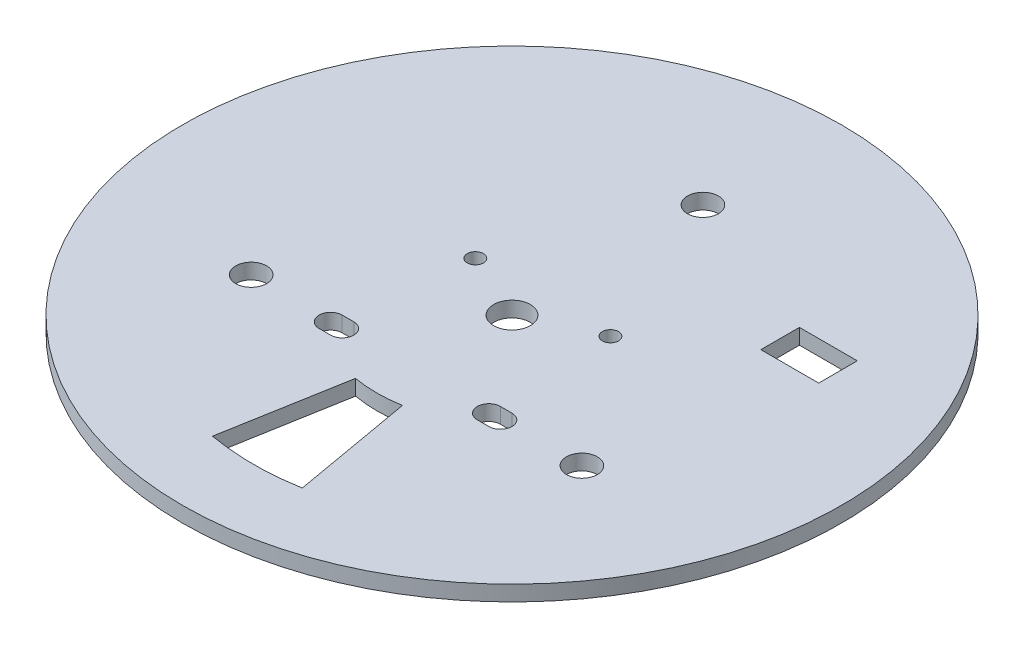
ISO-10303-21;
HEADER;
FILE_DESCRIPTION(('STEP AP214'),'2;1');
FILE_NAME('part.step','',(''),(''),'','','');
FILE_SCHEMA(('AUTOMOTIVE_DESIGN { 1 0 10303 214 1 1 1 1 }'));
ENDSEC;
DATA;
#1=APPLICATION_CONTEXT('core data for automotive mechanical design processes');
#2=APPLICATION_PROTOCOL_DEFINITION('international standard','automotive_design',2000,#1);
#3=PRODUCT_CONTEXT('',#1,'mechanical');
#4=PRODUCT('Part','Part','',(#3));
#5=PRODUCT_RELATED_PRODUCT_CATEGORY('part','',(#4));
#6=PRODUCT_DEFINITION_FORMATION('','',#4);
#7=PRODUCT_DEFINITION_CONTEXT('part definition',#1,'design');
#8=PRODUCT_DEFINITION('design','',#6,#7);
#9=PRODUCT_DEFINITION_SHAPE('','',#8);
#10=(LENGTH_UNIT() NAMED_UNIT(*) SI_UNIT(.MILLI.,.METRE.));
#11=(NAMED_UNIT(*) PLANE_ANGLE_UNIT() SI_UNIT($,.RADIAN.));
#12=(NAMED_UNIT(*) SI_UNIT($,.STERADIAN.) SOLID_ANGLE_UNIT());
#13=UNCERTAINTY_MEASURE_WITH_UNIT(LENGTH_MEASURE(1.E-05),#10,'distance_accuracy_value','');
#14=(GEOMETRIC_REPRESENTATION_CONTEXT(3) GLOBAL_UNCERTAINTY_ASSIGNED_CONTEXT((#13)) GLOBAL_UNIT_ASSIGNED_CONTEXT((#10,
#11,#12)) REPRESENTATION_CONTEXT('',''));
#15=CARTESIAN_POINT('',(0.,0.,0.));
#16=DIRECTION('',(0.,0.,1.));
#17=DIRECTION('',(1.,0.,0.));
#18=AXIS2_PLACEMENT_3D('',#15,#16,#17);
#19=CARTESIAN_POINT('',(0.,4.,0.));
#20=DIRECTION('',(0.,1.,0.));
#21=DIRECTION('',(0.,0.,1.));
#22=AXIS2_PLACEMENT_3D('',#19,#20,#21);
#23=PLANE('',#22);
#24=DIRECTION('',(0.,0.,-1.));
#25=VECTOR('',#24,1.);
#26=CARTESIAN_POINT('',(55.,4.,-34.48));
#27=LINE('',#26,#25);
#28=CARTESIAN_POINT('',(55.,4.,-24.48));
#29=VERTEX_POINT('',#28);
#30=CARTESIAN_POINT('',(55.,4.,-34.48));
#31=VERTEX_POINT('',#30);
#32=EDGE_CURVE('E48',#29,#31,#27,.T.);
#33=ORIENTED_EDGE('',*,*,#32,.F.);
#34=DIRECTION('',(1.,0.,0.));
#35=VECTOR('',#34,1.);
#36=CARTESIAN_POINT('',(55.,4.,-24.48));
#37=LINE('',#36,#35);
#38=CARTESIAN_POINT('',(40.,4.,-24.48));
#39=VERTEX_POINT('',#38);
#40=EDGE_CURVE('E154',#39,#29,#37,.T.);
#41=ORIENTED_EDGE('',*,*,#40,.F.);
#42=DIRECTION('',(0.,0.,1.));
#43=VECTOR('',#42,1.);
#44=CARTESIAN_POINT('',(40.,4.,-34.48));
#45=LINE('',#44,#43);
#46=CARTESIAN_POINT('',(40.,4.,-34.48));
#47=VERTEX_POINT('',#46);
#48=EDGE_CURVE('E174',#47,#39,#45,.T.);
#49=ORIENTED_EDGE('',*,*,#48,.F.);
#50=DIRECTION('',(-1.,0.,0.));
#51=VECTOR('',#50,1.);
#52=CARTESIAN_POINT('',(55.,4.,-34.48));
#53=LINE('',#52,#51);
#54=EDGE_CURVE('E168',#31,#47,#53,.T.);
#55=ORIENTED_EDGE('',*,*,#54,.F.);
#56=EDGE_LOOP('',(#33,#41,#49,#55));
#57=FACE_BOUND('',#56,.T.);
#58=CARTESIAN_POINT('',(17.5,4.,-7.99999999999999));
#59=DIRECTION('',(0.,1.,0.));
#60=DIRECTION('',(0.,0.,1.));
#61=AXIS2_PLACEMENT_3D('',#58,#59,#60);
#62=CIRCLE('',#61,2.09999999999999);
#63=CARTESIAN_POINT('',(17.5,4.,-5.89999999999999));
#64=VERTEX_POINT('',#63);
#65=EDGE_CURVE('E160',#64,#64,#62,.T.);
#66=ORIENTED_EDGE('',*,*,#65,.F.);
#67=EDGE_LOOP('',(#66));
#68=FACE_BOUND('',#67,.T.);
#69=CARTESIAN_POINT('',(-17.5,4.,-7.99999999999999));
#70=DIRECTION('',(0.,1.,0.));
#71=DIRECTION('',(0.,0.,1.));
#72=AXIS2_PLACEMENT_3D('',#69,#70,#71);
#73=CIRCLE('',#72,2.09999999999999);
#74=CARTESIAN_POINT('',(-17.5,4.,-5.9));
#75=VERTEX_POINT('',#74);
#76=EDGE_CURVE('E219',#75,#75,#73,.T.);
#77=ORIENTED_EDGE('',*,*,#76,.F.);
#78=EDGE_LOOP('',(#77));
#79=FACE_BOUND('',#78,.T.);
#80=CARTESIAN_POINT('',(-19.0000000000004,4.,25.0000000000002));
#81=DIRECTION('',(0.,1.,0.));
#82=DIRECTION('',(0.,0.,1.));
#83=AXIS2_PLACEMENT_3D('',#80,#81,#82);
#84=CIRCLE('',#83,3.);
#85=CARTESIAN_POINT('',(-19.0000000000004,4.,28.0000000000002));
#86=VERTEX_POINT('',#85);
#87=CARTESIAN_POINT('',(-19.0000000000004,4.,22.0000000000002));
#88=VERTEX_POINT('',#87);
#89=EDGE_CURVE('E197',#86,#88,#84,.T.);
#90=ORIENTED_EDGE('',*,*,#89,.F.);
#91=DIRECTION('',(1.,0.,0.));
#92=VECTOR('',#91,1.);
#93=CARTESIAN_POINT('',(-19.0000000000004,4.,28.0000000000002));
#94=LINE('',#93,#92);
#95=CARTESIAN_POINT('',(-22.0000000000004,4.,28.0000000000002));
#96=VERTEX_POINT('',#95);
#97=EDGE_CURVE('E187',#96,#86,#94,.T.);
#98=ORIENTED_EDGE('',*,*,#97,.F.);
#99=CARTESIAN_POINT('',(-22.0000000000004,4.,25.0000000000002));
#100=DIRECTION('',(0.,1.,0.));
#101=DIRECTION('',(0.,0.,1.));
#102=AXIS2_PLACEMENT_3D('',#99,#100,#101);
#103=CIRCLE('',#102,3.);
#104=CARTESIAN_POINT('',(-22.0000000000004,4.,22.0000000000002));
#105=VERTEX_POINT('',#104);
#106=EDGE_CURVE('E203',#105,#96,#103,.T.);
#107=ORIENTED_EDGE('',*,*,#106,.F.);
#108=DIRECTION('',(-1.,0.,0.));
#109=VECTOR('',#108,1.);
#110=CARTESIAN_POINT('',(-22.0000000000004,4.,22.0000000000002));
#111=LINE('',#110,#109);
#112=EDGE_CURVE('E199',#88,#105,#111,.T.);
#113=ORIENTED_EDGE('',*,*,#112,.F.);
#114=EDGE_LOOP('',(#90,#98,#107,#113));
#115=FACE_BOUND('',#114,.T.);
#116=CARTESIAN_POINT('',(19.0000000000005,4.,24.9999999999992));
#117=DIRECTION('',(0.,1.,0.));
#118=DIRECTION('',(0.,0.,1.));
#119=AXIS2_PLACEMENT_3D('',#116,#117,#118);
#120=CIRCLE('',#119,3.);
#121=CARTESIAN_POINT('',(19.0000000000005,4.,21.9999999999992));
#122=VERTEX_POINT('',#121);
#123=CARTESIAN_POINT('',(19.0000000000005,4.,27.9999999999992));
#124=VERTEX_POINT('',#123);
#125=EDGE_CURVE('E210',#122,#124,#120,.T.);
#126=ORIENTED_EDGE('',*,*,#125,.F.);
#127=DIRECTION('',(-1.,0.,0.));
#128=VECTOR('',#127,1.);
#129=CARTESIAN_POINT('',(22.0000000000005,4.,21.9999999999992));
#130=LINE('',#129,#128);
#131=CARTESIAN_POINT('',(22.0000000000005,4.,21.9999999999992));
#132=VERTEX_POINT('',#131);
#133=EDGE_CURVE('E231',#132,#122,#130,.T.);
#134=ORIENTED_EDGE('',*,*,#133,.F.);
#135=CARTESIAN_POINT('',(22.0000000000005,4.,24.9999999999992));
#136=DIRECTION('',(0.,1.,0.));
#137=DIRECTION('',(0.,0.,1.));
#138=AXIS2_PLACEMENT_3D('',#135,#136,#137);
#139=CIRCLE('',#138,3.);
#140=CARTESIAN_POINT('',(22.0000000000005,4.,27.9999999999992));
#141=VERTEX_POINT('',#140);
#142=EDGE_CURVE('E245',#141,#132,#139,.T.);
#143=ORIENTED_EDGE('',*,*,#142,.F.);
#144=DIRECTION('',(1.,0.,0.));
#145=VECTOR('',#144,1.);
#146=CARTESIAN_POINT('',(19.0000000000005,4.,27.9999999999992));
#147=LINE('',#146,#145);
#148=EDGE_CURVE('E242',#124,#141,#147,.T.);
#149=ORIENTED_EDGE('',*,*,#148,.F.);
#150=EDGE_LOOP('',(#126,#134,#143,#149));
#151=FACE_BOUND('',#150,.T.);
#152=CARTESIAN_POINT('',(0.,4.,0.));
#153=DIRECTION('',(0.,-1.,0.));
#154=DIRECTION('',(0.,0.,-1.));
#155=AXIS2_PLACEMENT_3D('',#152,#153,#154);
#156=CIRCLE('',#155,4.75);
#157=CARTESIAN_POINT('',(0.,4.,-4.75));
#158=VERTEX_POINT('',#157);
#159=EDGE_CURVE('E259',#158,#158,#156,.T.);
#160=ORIENTED_EDGE('',*,*,#159,.T.);
#161=EDGE_LOOP('',(#160));
#162=FACE_BOUND('',#161,.T.);
#163=CARTESIAN_POINT('',(42.850936979254,4.,24.7400000000001));
#164=DIRECTION('',(0.,1.,0.));
#165=DIRECTION('',(0.,0.,1.));
#166=AXIS2_PLACEMENT_3D('',#163,#164,#165);
#167=CIRCLE('',#166,4.);
#168=CARTESIAN_POINT('',(42.850936979254,4.,28.7400000000001));
#169=VERTEX_POINT('',#168);
#170=EDGE_CURVE('E269',#169,#169,#167,.T.);
#171=ORIENTED_EDGE('',*,*,#170,.F.);
#172=EDGE_LOOP('',(#171));
#173=FACE_BOUND('',#172,.T.);
#174=CARTESIAN_POINT('',(0.,4.,-49.48));
#175=DIRECTION('',(0.,1.,0.));
#176=DIRECTION('',(0.,0.,1.));
#177=AXIS2_PLACEMENT_3D('',#174,#175,#176);
#178=CIRCLE('',#177,4.);
#179=CARTESIAN_POINT('',(0.,4.,-45.48));
#180=VERTEX_POINT('',#179);
#181=EDGE_CURVE('E275',#180,#180,#178,.T.);
#182=ORIENTED_EDGE('',*,*,#181,.F.);
#183=EDGE_LOOP('',(#182));
#184=FACE_BOUND('',#183,.T.);
#185=CARTESIAN_POINT('',(-42.8509369792542,4.,24.7399999999997));
#186=DIRECTION('',(0.,1.,0.));
#187=DIRECTION('',(0.,0.,1.));
#188=AXIS2_PLACEMENT_3D('',#185,#186,#187);
#189=CIRCLE('',#188,4.00000000000001);
#190=CARTESIAN_POINT('',(-42.8509369792542,4.,28.7399999999998));
#191=VERTEX_POINT('',#190);
#192=EDGE_CURVE('E262',#191,#191,#189,.T.);
#193=ORIENTED_EDGE('',*,*,#192,.F.);
#194=EDGE_LOOP('',(#193));
#195=FACE_BOUND('',#194,.T.);
#196=CARTESIAN_POINT('',(0.,4.,0.));
#197=DIRECTION('',(0.,1.,0.));
#198=DIRECTION('',(0.,0.,1.));
#199=AXIS2_PLACEMENT_3D('',#196,#197,#198);
#200=CIRCLE('',#199,85.4);
#201=CARTESIAN_POINT('',(0.,4.,85.4));
#202=VERTEX_POINT('',#201);
#203=EDGE_CURVE('E11',#202,#202,#200,.T.);
#204=ORIENTED_EDGE('',*,*,#203,.T.);
#205=EDGE_LOOP('',(#204));
#206=FACE_BOUND('',#205,.T.);
#207=DIRECTION('',(-0.173648177666924,0.,0.984807753012209));
#208=VECTOR('',#207,1.);
#209=CARTESIAN_POINT('',(-6.07768621834235,4.,34.4682713554273));
#210=LINE('',#209,#208);
#211=CARTESIAN_POINT('',(-6.07768621834235,4.,34.4682713554273));
#212=VERTEX_POINT('',#211);
#213=CARTESIAN_POINT('',(-11.6344279036839,4.,65.982119451818));
#214=VERTEX_POINT('',#213);
#215=EDGE_CURVE('E285',#212,#214,#210,.T.);
#216=ORIENTED_EDGE('',*,*,#215,.F.);
#217=CARTESIAN_POINT('',(0.,4.,0.));
#218=DIRECTION('',(0.,-1.,0.));
#219=DIRECTION('',(0.,0.,-1.));
#220=AXIS2_PLACEMENT_3D('',#217,#218,#219);
#221=CIRCLE('',#220,35.);
#222=CARTESIAN_POINT('',(6.0776862183423,4.,34.4682713554273));
#223=VERTEX_POINT('',#222);
#224=EDGE_CURVE('E283',#223,#212,#221,.T.);
#225=ORIENTED_EDGE('',*,*,#224,.F.);
#226=DIRECTION('',(0.173648177666923,0.,0.984807753012209));
#227=VECTOR('',#226,1.);
#228=CARTESIAN_POINT('',(6.0776862183423,4.,34.4682713554273));
#229=LINE('',#228,#227);
#230=CARTESIAN_POINT('',(11.6344279036839,4.,65.982119451818));
#231=VERTEX_POINT('',#230);
#232=EDGE_CURVE('E291',#223,#231,#229,.T.);
#233=ORIENTED_EDGE('',*,*,#232,.T.);
#234=CARTESIAN_POINT('',(0.,4.,0.));
#235=DIRECTION('',(0.,-1.,0.));
#236=DIRECTION('',(0.,0.,-1.));
#237=AXIS2_PLACEMENT_3D('',#234,#235,#236);
#238=CIRCLE('',#237,67.);
#239=EDGE_CURVE('E288',#231,#214,#238,.T.);
#240=ORIENTED_EDGE('',*,*,#239,.T.);
#241=EDGE_LOOP('',(#216,#225,#233,#240));
#242=FACE_BOUND('',#241,.T.);
#243=ADVANCED_FACE('F33',(#57,#68,#79,#115,#151,#162,#173,#184,#195,#206,#242),#23,.T.);
#244=CARTESIAN_POINT('',(0.,0.,0.));
#245=DIRECTION('',(0.,1.,0.));
#246=DIRECTION('',(0.,0.,1.));
#247=AXIS2_PLACEMENT_3D('',#244,#245,#246);
#248=PLANE('',#247);
#249=DIRECTION('',(-1.,0.,0.));
#250=VECTOR('',#249,1.);
#251=CARTESIAN_POINT('',(55.,0.,-24.48));
#252=LINE('',#251,#250);
#253=CARTESIAN_POINT('',(55.,0.,-24.48));
#254=VERTEX_POINT('',#253);
#255=CARTESIAN_POINT('',(40.,0.,-24.48));
#256=VERTEX_POINT('',#255);
#257=EDGE_CURVE('E166',#254,#256,#252,.T.);
#258=ORIENTED_EDGE('',*,*,#257,.F.);
#259=DIRECTION('',(0.,0.,1.));
#260=VECTOR('',#259,1.);
#261=CARTESIAN_POINT('',(55.,0.,-34.48));
#262=LINE('',#261,#260);
#263=CARTESIAN_POINT('',(55.,0.,-34.48));
#264=VERTEX_POINT('',#263);
#265=EDGE_CURVE('E148',#264,#254,#262,.T.);
#266=ORIENTED_EDGE('',*,*,#265,.F.);
#267=DIRECTION('',(1.,0.,0.));
#268=VECTOR('',#267,1.);
#269=CARTESIAN_POINT('',(55.,0.,-34.48));
#270=LINE('',#269,#268);
#271=CARTESIAN_POINT('',(40.,0.,-34.48));
#272=VERTEX_POINT('',#271);
#273=EDGE_CURVE('E157',#272,#264,#270,.T.);
#274=ORIENTED_EDGE('',*,*,#273,.F.);
#275=DIRECTION('',(0.,0.,-1.));
#276=VECTOR('',#275,1.);
#277=CARTESIAN_POINT('',(40.,0.,-34.48));
#278=LINE('',#277,#276);
#279=EDGE_CURVE('E56',#256,#272,#278,.T.);
#280=ORIENTED_EDGE('',*,*,#279,.F.);
#281=EDGE_LOOP('',(#258,#266,#274,#280));
#282=FACE_BOUND('',#281,.T.);
#283=CARTESIAN_POINT('',(17.5,0.,-7.99999999999999));
#284=DIRECTION('',(0.,1.,0.));
#285=DIRECTION('',(0.,0.,1.));
#286=AXIS2_PLACEMENT_3D('',#283,#284,#285);
#287=CIRCLE('',#286,2.09999999999999);
#288=CARTESIAN_POINT('',(17.5,0.,-5.89999999999999));
#289=VERTEX_POINT('',#288);
#290=EDGE_CURVE('E222',#289,#289,#287,.T.);
#291=ORIENTED_EDGE('',*,*,#290,.T.);
#292=EDGE_LOOP('',(#291));
#293=FACE_BOUND('',#292,.T.);
#294=CARTESIAN_POINT('',(-17.5,0.,-7.99999999999999));
#295=DIRECTION('',(0.,1.,0.));
#296=DIRECTION('',(0.,0.,1.));
#297=AXIS2_PLACEMENT_3D('',#294,#295,#296);
#298=CIRCLE('',#297,2.09999999999999);
#299=CARTESIAN_POINT('',(-17.5,0.,-5.9));
#300=VERTEX_POINT('',#299);
#301=EDGE_CURVE('E200',#300,#300,#298,.T.);
#302=ORIENTED_EDGE('',*,*,#301,.T.);
#303=EDGE_LOOP('',(#302));
#304=FACE_BOUND('',#303,.T.);
#305=DIRECTION('',(1.,0.,0.));
#306=VECTOR('',#305,1.);
#307=CARTESIAN_POINT('',(-19.0000000000004,0.,28.0000000000002));
#308=LINE('',#307,#306);
#309=CARTESIAN_POINT('',(-22.0000000000004,0.,28.0000000000002));
#310=VERTEX_POINT('',#309);
#311=CARTESIAN_POINT('',(-19.0000000000004,0.,28.0000000000002));
#312=VERTEX_POINT('',#311);
#313=EDGE_CURVE('E193',#310,#312,#308,.T.);
#314=ORIENTED_EDGE('',*,*,#313,.T.);
#315=CARTESIAN_POINT('',(-19.0000000000004,0.,25.0000000000002));
#316=DIRECTION('',(0.,1.,0.));
#317=DIRECTION('',(0.,0.,1.));
#318=AXIS2_PLACEMENT_3D('',#315,#316,#317);
#319=CIRCLE('',#318,3.);
#320=CARTESIAN_POINT('',(-19.0000000000004,0.,22.0000000000002));
#321=VERTEX_POINT('',#320);
#322=EDGE_CURVE('E183',#312,#321,#319,.T.);
#323=ORIENTED_EDGE('',*,*,#322,.T.);
#324=DIRECTION('',(-1.,0.,0.));
#325=VECTOR('',#324,1.);
#326=CARTESIAN_POINT('',(-22.0000000000004,0.,22.0000000000002));
#327=LINE('',#326,#325);
#328=CARTESIAN_POINT('',(-22.0000000000004,0.,22.0000000000002));
#329=VERTEX_POINT('',#328);
#330=EDGE_CURVE('E186',#321,#329,#327,.T.);
#331=ORIENTED_EDGE('',*,*,#330,.T.);
#332=CARTESIAN_POINT('',(-22.0000000000004,0.,25.0000000000002));
#333=DIRECTION('',(0.,1.,0.));
#334=DIRECTION('',(0.,0.,1.));
#335=AXIS2_PLACEMENT_3D('',#332,#333,#334);
#336=CIRCLE('',#335,3.);
#337=EDGE_CURVE('E190',#329,#310,#336,.T.);
#338=ORIENTED_EDGE('',*,*,#337,.T.);
#339=EDGE_LOOP('',(#314,#323,#331,#338));
#340=FACE_BOUND('',#339,.T.);
#341=DIRECTION('',(-1.,0.,0.));
#342=VECTOR('',#341,1.);
#343=CARTESIAN_POINT('',(22.0000000000005,0.,21.9999999999992));
#344=LINE('',#343,#342);
#345=CARTESIAN_POINT('',(22.0000000000005,0.,21.9999999999992));
#346=VERTEX_POINT('',#345);
#347=CARTESIAN_POINT('',(19.0000000000005,0.,21.9999999999992));
#348=VERTEX_POINT('',#347);
#349=EDGE_CURVE('E237',#346,#348,#344,.T.);
#350=ORIENTED_EDGE('',*,*,#349,.T.);
#351=CARTESIAN_POINT('',(19.0000000000005,0.,24.9999999999992));
#352=DIRECTION('',(0.,1.,0.));
#353=DIRECTION('',(0.,0.,1.));
#354=AXIS2_PLACEMENT_3D('',#351,#352,#353);
#355=CIRCLE('',#354,3.);
#356=CARTESIAN_POINT('',(19.0000000000005,0.,27.9999999999992));
#357=VERTEX_POINT('',#356);
#358=EDGE_CURVE('E227',#348,#357,#355,.T.);
#359=ORIENTED_EDGE('',*,*,#358,.T.);
#360=DIRECTION('',(1.,0.,0.));
#361=VECTOR('',#360,1.);
#362=CARTESIAN_POINT('',(19.0000000000005,0.,27.9999999999992));
#363=LINE('',#362,#361);
#364=CARTESIAN_POINT('',(22.0000000000005,0.,27.9999999999992));
#365=VERTEX_POINT('',#364);
#366=EDGE_CURVE('E230',#357,#365,#363,.T.);
#367=ORIENTED_EDGE('',*,*,#366,.T.);
#368=CARTESIAN_POINT('',(22.0000000000005,0.,24.9999999999992));
#369=DIRECTION('',(0.,1.,0.));
#370=DIRECTION('',(0.,0.,1.));
#371=AXIS2_PLACEMENT_3D('',#368,#369,#370);
#372=CIRCLE('',#371,3.);
#373=EDGE_CURVE('E234',#365,#346,#372,.T.);
#374=ORIENTED_EDGE('',*,*,#373,.T.);
#375=EDGE_LOOP('',(#350,#359,#367,#374));
#376=FACE_BOUND('',#375,.T.);
#377=CARTESIAN_POINT('',(0.,0.,0.));
#378=DIRECTION('',(0.,-1.,0.));
#379=DIRECTION('',(0.,0.,-1.));
#380=AXIS2_PLACEMENT_3D('',#377,#378,#379);
#381=CIRCLE('',#380,4.75);
#382=CARTESIAN_POINT('',(0.,0.,-4.75));
#383=VERTEX_POINT('',#382);
#384=EDGE_CURVE('E252',#383,#383,#381,.T.);
#385=ORIENTED_EDGE('',*,*,#384,.F.);
#386=EDGE_LOOP('',(#385));
#387=FACE_BOUND('',#386,.T.);
#388=CARTESIAN_POINT('',(42.850936979254,0.,24.7400000000001));
#389=DIRECTION('',(0.,1.,0.));
#390=DIRECTION('',(0.,0.,1.));
#391=AXIS2_PLACEMENT_3D('',#388,#389,#390);
#392=CIRCLE('',#391,4.);
#393=CARTESIAN_POINT('',(42.850936979254,0.,28.7400000000001));
#394=VERTEX_POINT('',#393);
#395=EDGE_CURVE('E265',#394,#394,#392,.T.);
#396=ORIENTED_EDGE('',*,*,#395,.T.);
#397=EDGE_LOOP('',(#396));
#398=FACE_BOUND('',#397,.T.);
#399=CARTESIAN_POINT('',(0.,0.,-49.48));
#400=DIRECTION('',(0.,1.,0.));
#401=DIRECTION('',(0.,0.,1.));
#402=AXIS2_PLACEMENT_3D('',#399,#400,#401);
#403=CIRCLE('',#402,4.);
#404=CARTESIAN_POINT('',(0.,0.,-45.48));
#405=VERTEX_POINT('',#404);
#406=EDGE_CURVE('E272',#405,#405,#403,.T.);
#407=ORIENTED_EDGE('',*,*,#406,.T.);
#408=EDGE_LOOP('',(#407));
#409=FACE_BOUND('',#408,.T.);
#410=CARTESIAN_POINT('',(-42.8509369792542,0.,24.7399999999997));
#411=DIRECTION('',(0.,1.,0.));
#412=DIRECTION('',(0.,0.,1.));
#413=AXIS2_PLACEMENT_3D('',#410,#411,#412);
#414=CIRCLE('',#413,4.00000000000001);
#415=CARTESIAN_POINT('',(-42.8509369792542,0.,28.7399999999998));
#416=VERTEX_POINT('',#415);
#417=EDGE_CURVE('E278',#416,#416,#414,.T.);
#418=ORIENTED_EDGE('',*,*,#417,.T.);
#419=EDGE_LOOP('',(#418));
#420=FACE_BOUND('',#419,.T.);
#421=CARTESIAN_POINT('',(0.,0.,0.));
#422=DIRECTION('',(0.,1.,0.));
#423=DIRECTION('',(0.,0.,1.));
#424=AXIS2_PLACEMENT_3D('',#421,#422,#423);
#425=CIRCLE('',#424,85.4);
#426=CARTESIAN_POINT('',(0.,0.,85.4));
#427=VERTEX_POINT('',#426);
#428=EDGE_CURVE('E37',#427,#427,#425,.T.);
#429=ORIENTED_EDGE('',*,*,#428,.F.);
#430=EDGE_LOOP('',(#429));
#431=FACE_BOUND('',#430,.T.);
#432=CARTESIAN_POINT('',(0.,0.,0.));
#433=DIRECTION('',(0.,-1.,0.));
#434=DIRECTION('',(0.,0.,-1.));
#435=AXIS2_PLACEMENT_3D('',#432,#433,#434);
#436=CIRCLE('',#435,35.);
#437=CARTESIAN_POINT('',(6.0776862183423,0.,34.4682713554273));
#438=VERTEX_POINT('',#437);
#439=CARTESIAN_POINT('',(-6.07768621834235,0.,34.4682713554273));
#440=VERTEX_POINT('',#439);
#441=EDGE_CURVE('E268',#438,#440,#436,.T.);
#442=ORIENTED_EDGE('',*,*,#441,.T.);
#443=DIRECTION('',(-0.173648177666924,0.,0.984807753012209));
#444=VECTOR('',#443,1.);
#445=CARTESIAN_POINT('',(-6.07768621834235,0.,34.4682713554273));
#446=LINE('',#445,#444);
#447=CARTESIAN_POINT('',(-11.6344279036839,0.,65.982119451818));
#448=VERTEX_POINT('',#447);
#449=EDGE_CURVE('E297',#440,#448,#446,.T.);
#450=ORIENTED_EDGE('',*,*,#449,.T.);
#451=CARTESIAN_POINT('',(0.,0.,0.));
#452=DIRECTION('',(0.,-1.,0.));
#453=DIRECTION('',(0.,0.,-1.));
#454=AXIS2_PLACEMENT_3D('',#451,#452,#453);
#455=CIRCLE('',#454,67.);
#456=CARTESIAN_POINT('',(11.6344279036839,0.,65.982119451818));
#457=VERTEX_POINT('',#456);
#458=EDGE_CURVE('E300',#457,#448,#455,.T.);
#459=ORIENTED_EDGE('',*,*,#458,.F.);
#460=DIRECTION('',(0.173648177666923,0.,0.984807753012209));
#461=VECTOR('',#460,1.);
#462=CARTESIAN_POINT('',(6.0776862183423,0.,34.4682713554273));
#463=LINE('',#462,#461);
#464=EDGE_CURVE('E286',#438,#457,#463,.T.);
#465=ORIENTED_EDGE('',*,*,#464,.F.);
#466=EDGE_LOOP('',(#442,#450,#459,#465));
#467=FACE_BOUND('',#466,.T.);
#468=ADVANCED_FACE('F163',(#282,#293,#304,#340,#376,#387,#398,#409,#420,#431,#467),#248,.F.);
#469=CARTESIAN_POINT('',(0.,4.,0.));
#470=DIRECTION('',(0.,-1.,0.));
#471=DIRECTION('',(0.,0.,-1.));
#472=AXIS2_PLACEMENT_3D('',#469,#470,#471);
#473=CYLINDRICAL_SURFACE('',#472,85.4);
#474=ORIENTED_EDGE('',*,*,#203,.F.);
#475=EDGE_LOOP('',(#474));
#476=FACE_BOUND('',#475,.T.);
#477=ORIENTED_EDGE('',*,*,#428,.T.);
#478=EDGE_LOOP('',(#477));
#479=FACE_BOUND('',#478,.T.);
#480=ADVANCED_FACE('F35',(#476,#479),#473,.T.);
#481=CARTESIAN_POINT('',(0.,4.,0.));
#482=DIRECTION('',(0.,-1.,0.));
#483=DIRECTION('',(0.,0.,-1.));
#484=AXIS2_PLACEMENT_3D('',#481,#482,#483);
#485=CYLINDRICAL_SURFACE('',#484,35.);
#486=ORIENTED_EDGE('',*,*,#441,.F.);
#487=DIRECTION('',(0.,-1.,0.));
#488=VECTOR('',#487,1.);
#489=CARTESIAN_POINT('',(6.0776862183423,4.,34.4682713554273));
#490=LINE('',#489,#488);
#491=EDGE_CURVE('E294',#223,#438,#490,.T.);
#492=ORIENTED_EDGE('',*,*,#491,.F.);
#493=ORIENTED_EDGE('',*,*,#224,.T.);
#494=DIRECTION('',(0.,-1.,0.));
#495=VECTOR('',#494,1.);
#496=CARTESIAN_POINT('',(-6.07768621834235,4.,34.4682713554273));
#497=LINE('',#496,#495);
#498=EDGE_CURVE('E311',#212,#440,#497,.T.);
#499=ORIENTED_EDGE('',*,*,#498,.T.);
#500=EDGE_LOOP('',(#486,#492,#493,#499));
#501=FACE_BOUND('',#500,.T.);
#502=ADVANCED_FACE('F323',(#501),#485,.T.);
#503=CARTESIAN_POINT('',(-6.07768621834235,4.,34.4682713554273));
#504=DIRECTION('',(0.984807753012209,0.,0.173648177666924));
#505=DIRECTION('',(0.173648177666924,0.,-0.984807753012209));
#506=AXIS2_PLACEMENT_3D('',#503,#504,#505);
#507=PLANE('',#506);
#508=ORIENTED_EDGE('',*,*,#449,.F.);
#509=ORIENTED_EDGE('',*,*,#498,.F.);
#510=ORIENTED_EDGE('',*,*,#215,.T.);
#511=DIRECTION('',(0.,-1.,0.));
#512=VECTOR('',#511,1.);
#513=CARTESIAN_POINT('',(-11.6344279036839,4.,65.982119451818));
#514=LINE('',#513,#512);
#515=EDGE_CURVE('E309',#214,#448,#514,.T.);
#516=ORIENTED_EDGE('',*,*,#515,.T.);
#517=EDGE_LOOP('',(#508,#509,#510,#516));
#518=FACE_BOUND('',#517,.T.);
#519=ADVANCED_FACE('F332',(#518),#507,.T.);
#520=CARTESIAN_POINT('',(0.,4.,0.));
#521=DIRECTION('',(0.,-1.,0.));
#522=DIRECTION('',(0.,0.,-1.));
#523=AXIS2_PLACEMENT_3D('',#520,#521,#522);
#524=CYLINDRICAL_SURFACE('',#523,67.);
#525=ORIENTED_EDGE('',*,*,#458,.T.);
#526=ORIENTED_EDGE('',*,*,#515,.F.);
#527=ORIENTED_EDGE('',*,*,#239,.F.);
#528=DIRECTION('',(0.,-1.,0.));
#529=VECTOR('',#528,1.);
#530=CARTESIAN_POINT('',(11.6344279036839,4.,65.982119451818));
#531=LINE('',#530,#529);
#532=EDGE_CURVE('E307',#231,#457,#531,.T.);
#533=ORIENTED_EDGE('',*,*,#532,.T.);
#534=EDGE_LOOP('',(#525,#526,#527,#533));
#535=FACE_BOUND('',#534,.T.);
#536=ADVANCED_FACE('F335',(#535),#524,.F.);
#537=CARTESIAN_POINT('',(6.0776862183423,4.,34.4682713554273));
#538=DIRECTION('',(0.984807753012209,0.,-0.173648177666923));
#539=DIRECTION('',(-0.173648177666923,0.,-0.984807753012209));
#540=AXIS2_PLACEMENT_3D('',#537,#538,#539);
#541=PLANE('',#540);
#542=ORIENTED_EDGE('',*,*,#464,.T.);
#543=ORIENTED_EDGE('',*,*,#532,.F.);
#544=ORIENTED_EDGE('',*,*,#232,.F.);
#545=ORIENTED_EDGE('',*,*,#491,.T.);
#546=EDGE_LOOP('',(#542,#543,#544,#545));
#547=FACE_BOUND('',#546,.T.);
#548=ADVANCED_FACE('F326',(#547),#541,.F.);
#549=CARTESIAN_POINT('',(-42.8509369792542,0.,24.7399999999997));
#550=DIRECTION('',(0.,1.,0.));
#551=DIRECTION('',(0.,0.,1.));
#552=AXIS2_PLACEMENT_3D('',#549,#550,#551);
#553=CYLINDRICAL_SURFACE('',#552,4.00000000000001);
#554=ORIENTED_EDGE('',*,*,#417,.F.);
#555=EDGE_LOOP('',(#554));
#556=FACE_BOUND('',#555,.T.);
#557=ORIENTED_EDGE('',*,*,#192,.T.);
#558=EDGE_LOOP('',(#557));
#559=FACE_BOUND('',#558,.T.);
#560=ADVANCED_FACE('F342',(#556,#559),#553,.F.);
#561=CARTESIAN_POINT('',(0.,0.,-49.48));
#562=DIRECTION('',(0.,1.,0.));
#563=DIRECTION('',(0.,0.,1.));
#564=AXIS2_PLACEMENT_3D('',#561,#562,#563);
#565=CYLINDRICAL_SURFACE('',#564,4.);
#566=ORIENTED_EDGE('',*,*,#406,.F.);
#567=EDGE_LOOP('',(#566));
#568=FACE_BOUND('',#567,.T.);
#569=ORIENTED_EDGE('',*,*,#181,.T.);
#570=EDGE_LOOP('',(#569));
#571=FACE_BOUND('',#570,.T.);
#572=ADVANCED_FACE('F399',(#568,#571),#565,.F.);
#573=CARTESIAN_POINT('',(42.850936979254,0.,24.7400000000001));
#574=DIRECTION('',(0.,1.,0.));
#575=DIRECTION('',(0.,0.,1.));
#576=AXIS2_PLACEMENT_3D('',#573,#574,#575);
#577=CYLINDRICAL_SURFACE('',#576,4.);
#578=ORIENTED_EDGE('',*,*,#395,.F.);
#579=EDGE_LOOP('',(#578));
#580=FACE_BOUND('',#579,.T.);
#581=ORIENTED_EDGE('',*,*,#170,.T.);
#582=EDGE_LOOP('',(#581));
#583=FACE_BOUND('',#582,.T.);
#584=ADVANCED_FACE('F408',(#580,#583),#577,.F.);
#585=CARTESIAN_POINT('',(0.,4.,0.));
#586=DIRECTION('',(0.,-1.,0.));
#587=DIRECTION('',(0.,0.,-1.));
#588=AXIS2_PLACEMENT_3D('',#585,#586,#587);
#589=CYLINDRICAL_SURFACE('',#588,4.75);
#590=ORIENTED_EDGE('',*,*,#159,.F.);
#591=EDGE_LOOP('',(#590));
#592=FACE_BOUND('',#591,.T.);
#593=ORIENTED_EDGE('',*,*,#384,.T.);
#594=EDGE_LOOP('',(#593));
#595=FACE_BOUND('',#594,.T.);
#596=ADVANCED_FACE('F417',(#592,#595),#589,.F.);
#597=CARTESIAN_POINT('',(19.0000000000005,0.,24.9999999999992));
#598=DIRECTION('',(0.,1.,0.));
#599=DIRECTION('',(0.,0.,1.));
#600=AXIS2_PLACEMENT_3D('',#597,#598,#599);
#601=CYLINDRICAL_SURFACE('',#600,3.);
#602=ORIENTED_EDGE('',*,*,#125,.T.);
#603=DIRECTION('',(0.,1.,0.));
#604=VECTOR('',#603,1.);
#605=CARTESIAN_POINT('',(19.0000000000005,0.,27.9999999999992));
#606=LINE('',#605,#604);
#607=EDGE_CURVE('E240',#357,#124,#606,.T.);
#608=ORIENTED_EDGE('',*,*,#607,.F.);
#609=ORIENTED_EDGE('',*,*,#358,.F.);
#610=DIRECTION('',(0.,1.,0.));
#611=VECTOR('',#610,1.);
#612=CARTESIAN_POINT('',(19.0000000000005,0.,21.9999999999992));
#613=LINE('',#612,#611);
#614=EDGE_CURVE('E250',#348,#122,#613,.T.);
#615=ORIENTED_EDGE('',*,*,#614,.T.);
#616=EDGE_LOOP('',(#602,#608,#609,#615));
#617=FACE_BOUND('',#616,.T.);
#618=ADVANCED_FACE('F426',(#617),#601,.F.);
#619=CARTESIAN_POINT('',(22.0000000000005,0.,21.9999999999992));
#620=DIRECTION('',(0.,0.,-1.));
#621=DIRECTION('',(-1.,0.,0.));
#622=AXIS2_PLACEMENT_3D('',#619,#620,#621);
#623=PLANE('',#622);
#624=ORIENTED_EDGE('',*,*,#133,.T.);
#625=ORIENTED_EDGE('',*,*,#614,.F.);
#626=ORIENTED_EDGE('',*,*,#349,.F.);
#627=DIRECTION('',(0.,1.,0.));
#628=VECTOR('',#627,1.);
#629=CARTESIAN_POINT('',(22.0000000000005,0.,21.9999999999992));
#630=LINE('',#629,#628);
#631=EDGE_CURVE('E253',#346,#132,#630,.T.);
#632=ORIENTED_EDGE('',*,*,#631,.T.);
#633=EDGE_LOOP('',(#624,#625,#626,#632));
#634=FACE_BOUND('',#633,.T.);
#635=ADVANCED_FACE('F435',(#634),#623,.F.);
#636=CARTESIAN_POINT('',(22.0000000000005,0.,24.9999999999992));
#637=DIRECTION('',(0.,1.,0.));
#638=DIRECTION('',(0.,0.,1.));
#639=AXIS2_PLACEMENT_3D('',#636,#637,#638);
#640=CYLINDRICAL_SURFACE('',#639,3.);
#641=ORIENTED_EDGE('',*,*,#142,.T.);
#642=ORIENTED_EDGE('',*,*,#631,.F.);
#643=ORIENTED_EDGE('',*,*,#373,.F.);
#644=DIRECTION('',(0.,1.,0.));
#645=VECTOR('',#644,1.);
#646=CARTESIAN_POINT('',(22.0000000000005,0.,27.9999999999992));
#647=LINE('',#646,#645);
#648=EDGE_CURVE('E255',#365,#141,#647,.T.);
#649=ORIENTED_EDGE('',*,*,#648,.T.);
#650=EDGE_LOOP('',(#641,#642,#643,#649));
#651=FACE_BOUND('',#650,.T.);
#652=ADVANCED_FACE('F444',(#651),#640,.F.);
#653=CARTESIAN_POINT('',(19.0000000000005,0.,27.9999999999992));
#654=DIRECTION('',(0.,0.,1.));
#655=DIRECTION('',(1.,0.,0.));
#656=AXIS2_PLACEMENT_3D('',#653,#654,#655);
#657=PLANE('',#656);
#658=ORIENTED_EDGE('',*,*,#148,.T.);
#659=ORIENTED_EDGE('',*,*,#648,.F.);
#660=ORIENTED_EDGE('',*,*,#366,.F.);
#661=ORIENTED_EDGE('',*,*,#607,.T.);
#662=EDGE_LOOP('',(#658,#659,#660,#661));
#663=FACE_BOUND('',#662,.T.);
#664=ADVANCED_FACE('F453',(#663),#657,.F.);
#665=CARTESIAN_POINT('',(-19.0000000000004,0.,25.0000000000002));
#666=DIRECTION('',(0.,1.,0.));
#667=DIRECTION('',(0.,0.,1.));
#668=AXIS2_PLACEMENT_3D('',#665,#666,#667);
#669=CYLINDRICAL_SURFACE('',#668,3.);
#670=ORIENTED_EDGE('',*,*,#89,.T.);
#671=DIRECTION('',(0.,1.,0.));
#672=VECTOR('',#671,1.);
#673=CARTESIAN_POINT('',(-19.0000000000004,0.,22.0000000000002));
#674=LINE('',#673,#672);
#675=EDGE_CURVE('E196',#321,#88,#674,.T.);
#676=ORIENTED_EDGE('',*,*,#675,.F.);
#677=ORIENTED_EDGE('',*,*,#322,.F.);
#678=DIRECTION('',(0.,1.,0.));
#679=VECTOR('',#678,1.);
#680=CARTESIAN_POINT('',(-19.0000000000004,0.,28.0000000000002));
#681=LINE('',#680,#679);
#682=EDGE_CURVE('E208',#312,#86,#681,.T.);
#683=ORIENTED_EDGE('',*,*,#682,.T.);
#684=EDGE_LOOP('',(#670,#676,#677,#683));
#685=FACE_BOUND('',#684,.T.);
#686=ADVANCED_FACE('F462',(#685),#669,.F.);
#687=CARTESIAN_POINT('',(-19.0000000000004,0.,28.0000000000002));
#688=DIRECTION('',(0.,0.,1.));
#689=DIRECTION('',(1.,0.,0.));
#690=AXIS2_PLACEMENT_3D('',#687,#688,#689);
#691=PLANE('',#690);
#692=ORIENTED_EDGE('',*,*,#97,.T.);
#693=ORIENTED_EDGE('',*,*,#682,.F.);
#694=ORIENTED_EDGE('',*,*,#313,.F.);
#695=DIRECTION('',(0.,1.,0.));
#696=VECTOR('',#695,1.);
#697=CARTESIAN_POINT('',(-22.0000000000004,0.,28.0000000000002));
#698=LINE('',#697,#696);
#699=EDGE_CURVE('E211',#310,#96,#698,.T.);
#700=ORIENTED_EDGE('',*,*,#699,.T.);
#701=EDGE_LOOP('',(#692,#693,#694,#700));
#702=FACE_BOUND('',#701,.T.);
#703=ADVANCED_FACE('F471',(#702),#691,.F.);
#704=CARTESIAN_POINT('',(-22.0000000000004,0.,25.0000000000002));
#705=DIRECTION('',(0.,1.,0.));
#706=DIRECTION('',(0.,0.,1.));
#707=AXIS2_PLACEMENT_3D('',#704,#705,#706);
#708=CYLINDRICAL_SURFACE('',#707,3.);
#709=ORIENTED_EDGE('',*,*,#106,.T.);
#710=ORIENTED_EDGE('',*,*,#699,.F.);
#711=ORIENTED_EDGE('',*,*,#337,.F.);
#712=DIRECTION('',(0.,1.,0.));
#713=VECTOR('',#712,1.);
#714=CARTESIAN_POINT('',(-22.0000000000004,0.,22.0000000000002));
#715=LINE('',#714,#713);
#716=EDGE_CURVE('E213',#329,#105,#715,.T.);
#717=ORIENTED_EDGE('',*,*,#716,.T.);
#718=EDGE_LOOP('',(#709,#710,#711,#717));
#719=FACE_BOUND('',#718,.T.);
#720=ADVANCED_FACE('F480',(#719),#708,.F.);
#721=CARTESIAN_POINT('',(-22.0000000000004,0.,22.0000000000002));
#722=DIRECTION('',(0.,0.,-1.));
#723=DIRECTION('',(-1.,0.,0.));
#724=AXIS2_PLACEMENT_3D('',#721,#722,#723);
#725=PLANE('',#724);
#726=ORIENTED_EDGE('',*,*,#112,.T.);
#727=ORIENTED_EDGE('',*,*,#716,.F.);
#728=ORIENTED_EDGE('',*,*,#330,.F.);
#729=ORIENTED_EDGE('',*,*,#675,.T.);
#730=EDGE_LOOP('',(#726,#727,#728,#729));
#731=FACE_BOUND('',#730,.T.);
#732=ADVANCED_FACE('F489',(#731),#725,.F.);
#733=CARTESIAN_POINT('',(-17.5,0.,-7.99999999999999));
#734=DIRECTION('',(0.,1.,0.));
#735=DIRECTION('',(0.,0.,1.));
#736=AXIS2_PLACEMENT_3D('',#733,#734,#735);
#737=CYLINDRICAL_SURFACE('',#736,2.09999999999999);
#738=ORIENTED_EDGE('',*,*,#301,.F.);
#739=EDGE_LOOP('',(#738));
#740=FACE_BOUND('',#739,.T.);
#741=ORIENTED_EDGE('',*,*,#76,.T.);
#742=EDGE_LOOP('',(#741));
#743=FACE_BOUND('',#742,.T.);
#744=ADVANCED_FACE('F498',(#740,#743),#737,.F.);
#745=CARTESIAN_POINT('',(17.5,0.,-7.99999999999999));
#746=DIRECTION('',(0.,1.,0.));
#747=DIRECTION('',(0.,0.,1.));
#748=AXIS2_PLACEMENT_3D('',#745,#746,#747);
#749=CYLINDRICAL_SURFACE('',#748,2.09999999999999);
#750=ORIENTED_EDGE('',*,*,#290,.F.);
#751=EDGE_LOOP('',(#750));
#752=FACE_BOUND('',#751,.T.);
#753=ORIENTED_EDGE('',*,*,#65,.T.);
#754=EDGE_LOOP('',(#753));
#755=FACE_BOUND('',#754,.T.);
#756=ADVANCED_FACE('F507',(#752,#755),#749,.F.);
#757=CARTESIAN_POINT('',(55.,-0.00100000000000013,-34.48));
#758=DIRECTION('',(1.,0.,0.));
#759=DIRECTION('',(0.,0.,-1.));
#760=AXIS2_PLACEMENT_3D('',#757,#758,#759);
#761=PLANE('',#760);
#762=ORIENTED_EDGE('',*,*,#265,.T.);
#763=DIRECTION('',(0.,1.,0.));
#764=VECTOR('',#763,1.);
#765=CARTESIAN_POINT('',(55.,-0.00100000000000013,-24.48));
#766=LINE('',#765,#764);
#767=EDGE_CURVE('E161',#254,#29,#766,.T.);
#768=ORIENTED_EDGE('',*,*,#767,.T.);
#769=ORIENTED_EDGE('',*,*,#32,.T.);
#770=DIRECTION('',(0.,1.,0.));
#771=VECTOR('',#770,1.);
#772=CARTESIAN_POINT('',(55.,-0.00100000000000013,-34.48));
#773=LINE('',#772,#771);
#774=EDGE_CURVE('E144',#264,#31,#773,.T.);
#775=ORIENTED_EDGE('',*,*,#774,.F.);
#776=EDGE_LOOP('',(#762,#768,#769,#775));
#777=FACE_BOUND('',#776,.T.);
#778=ADVANCED_FACE('F146',(#777),#761,.F.);
#779=CARTESIAN_POINT('',(55.,-0.00100000000000013,-24.48));
#780=DIRECTION('',(0.,0.,1.));
#781=DIRECTION('',(1.,0.,0.));
#782=AXIS2_PLACEMENT_3D('',#779,#780,#781);
#783=PLANE('',#782);
#784=ORIENTED_EDGE('',*,*,#257,.T.);
#785=DIRECTION('',(0.,1.,0.));
#786=VECTOR('',#785,1.);
#787=CARTESIAN_POINT('',(40.,-0.00100000000000013,-24.48));
#788=LINE('',#787,#786);
#789=EDGE_CURVE('E180',#256,#39,#788,.T.);
#790=ORIENTED_EDGE('',*,*,#789,.T.);
#791=ORIENTED_EDGE('',*,*,#40,.T.);
#792=ORIENTED_EDGE('',*,*,#767,.F.);
#793=EDGE_LOOP('',(#784,#790,#791,#792));
#794=FACE_BOUND('',#793,.T.);
#795=ADVANCED_FACE('F522',(#794),#783,.F.);
#796=CARTESIAN_POINT('',(40.,-0.00100000000000013,-34.48));
#797=DIRECTION('',(-1.,0.,0.));
#798=DIRECTION('',(0.,0.,1.));
#799=AXIS2_PLACEMENT_3D('',#796,#797,#798);
#800=PLANE('',#799);
#801=ORIENTED_EDGE('',*,*,#279,.T.);
#802=DIRECTION('',(0.,1.,0.));
#803=VECTOR('',#802,1.);
#804=CARTESIAN_POINT('',(40.,-0.00100000000000013,-34.48));
#805=LINE('',#804,#803);
#806=EDGE_CURVE('E153',#272,#47,#805,.T.);
#807=ORIENTED_EDGE('',*,*,#806,.T.);
#808=ORIENTED_EDGE('',*,*,#48,.T.);
#809=ORIENTED_EDGE('',*,*,#789,.F.);
#810=EDGE_LOOP('',(#801,#807,#808,#809));
#811=FACE_BOUND('',#810,.T.);
#812=ADVANCED_FACE('F530',(#811),#800,.F.);
#813=CARTESIAN_POINT('',(55.,-0.00100000000000013,-34.48));
#814=DIRECTION('',(0.,0.,-1.));
#815=DIRECTION('',(-1.,0.,0.));
#816=AXIS2_PLACEMENT_3D('',#813,#814,#815);
#817=PLANE('',#816);
#818=ORIENTED_EDGE('',*,*,#273,.T.);
#819=ORIENTED_EDGE('',*,*,#774,.T.);
#820=ORIENTED_EDGE('',*,*,#54,.T.);
#821=ORIENTED_EDGE('',*,*,#806,.F.);
#822=EDGE_LOOP('',(#818,#819,#820,#821));
#823=FACE_BOUND('',#822,.T.);
#824=ADVANCED_FACE('F158',(#823),#817,.F.);
#825=CLOSED_SHELL('',(#243,#468,#480,#502,#519,#536,#548,#560,#572,#584,#596,#618,#635,#652,
#664,#686,#703,#720,#732,#744,#756,#778,#795,#812,#824));
#826=MANIFOLD_SOLID_BREP('B2',#825);
#827=ADVANCED_BREP_SHAPE_REPRESENTATION('',(#18,#826),#14);
#828=SHAPE_DEFINITION_REPRESENTATION(#9,#827);
ENDSEC;
END-ISO-10303-21;
